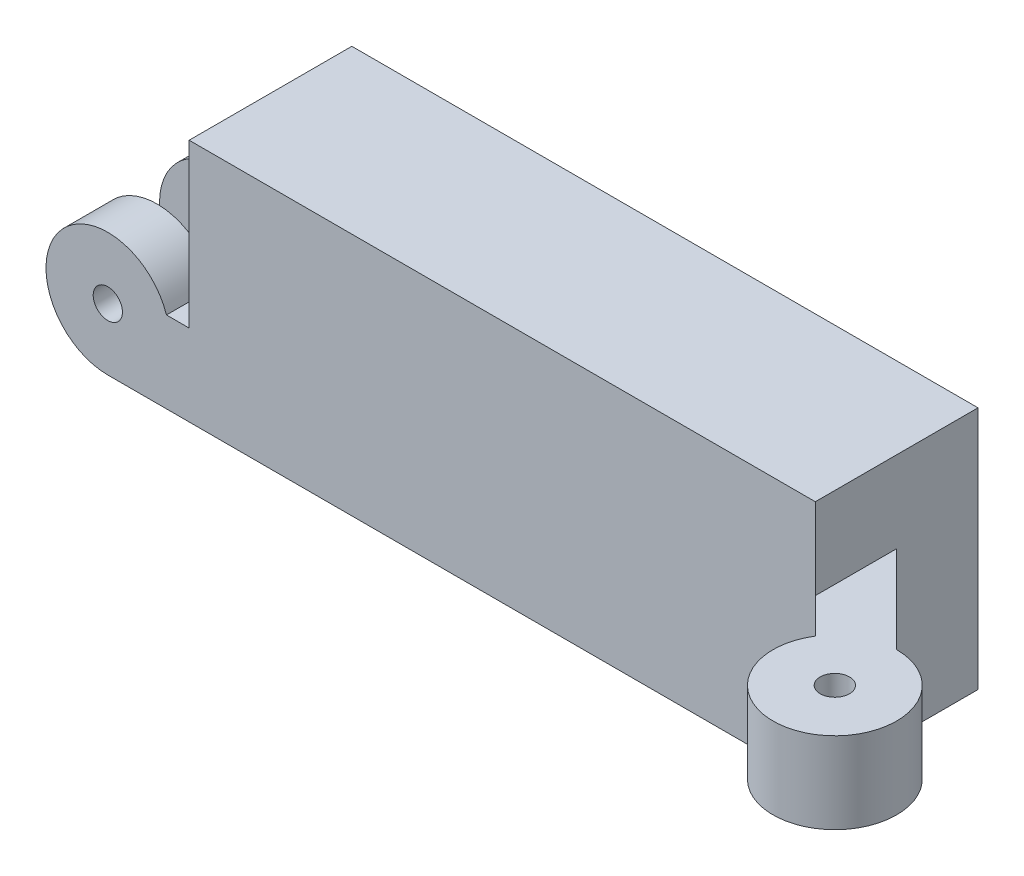
ISO-10303-21;
HEADER;
FILE_DESCRIPTION(('STEP AP214'),'2;1');
FILE_NAME('part.step','',(''),(''),'','','');
FILE_SCHEMA(('AUTOMOTIVE_DESIGN { 1 0 10303 214 1 1 1 1 }'));
ENDSEC;
DATA;
#1=APPLICATION_CONTEXT('core data for automotive mechanical design processes');
#2=APPLICATION_PROTOCOL_DEFINITION('international standard','automotive_design',2000,#1);
#3=PRODUCT_CONTEXT('',#1,'mechanical');
#4=PRODUCT('Part','Part','',(#3));
#5=PRODUCT_RELATED_PRODUCT_CATEGORY('part','',(#4));
#6=PRODUCT_DEFINITION_FORMATION('','',#4);
#7=PRODUCT_DEFINITION_CONTEXT('part definition',#1,'design');
#8=PRODUCT_DEFINITION('design','',#6,#7);
#9=PRODUCT_DEFINITION_SHAPE('','',#8);
#10=(LENGTH_UNIT() NAMED_UNIT(*) SI_UNIT(.MILLI.,.METRE.));
#11=(NAMED_UNIT(*) PLANE_ANGLE_UNIT() SI_UNIT($,.RADIAN.));
#12=(NAMED_UNIT(*) SI_UNIT($,.STERADIAN.) SOLID_ANGLE_UNIT());
#13=UNCERTAINTY_MEASURE_WITH_UNIT(LENGTH_MEASURE(1.E-05),#10,'distance_accuracy_value','');
#14=(GEOMETRIC_REPRESENTATION_CONTEXT(3) GLOBAL_UNCERTAINTY_ASSIGNED_CONTEXT((#13)) GLOBAL_UNIT_ASSIGNED_CONTEXT((#10,
#11,#12)) REPRESENTATION_CONTEXT('',''));
#15=CARTESIAN_POINT('',(0.,0.,0.));
#16=DIRECTION('',(0.,0.,1.));
#17=DIRECTION('',(1.,0.,0.));
#18=AXIS2_PLACEMENT_3D('',#15,#16,#17);
#19=CARTESIAN_POINT('',(48.881284,0.,12.7));
#20=DIRECTION('',(-1.,0.,0.));
#21=DIRECTION('',(0.,0.,1.));
#22=AXIS2_PLACEMENT_3D('',#19,#20,#21);
#23=PLANE('',#22);
#24=DIRECTION('',(0.,0.,1.));
#25=VECTOR('',#24,1.);
#26=CARTESIAN_POINT('',(48.8812840000037,12.7,291599.365));
#27=LINE('',#26,#25);
#28=CARTESIAN_POINT('',(48.8812840000037,12.7,6.34999999999764));
#29=VERTEX_POINT('',#28);
#30=CARTESIAN_POINT('',(48.8812840000037,12.7,12.6999999999953));
#31=VERTEX_POINT('',#30);
#32=EDGE_CURVE('E173',#29,#31,#27,.T.);
#33=ORIENTED_EDGE('',*,*,#32,.F.);
#34=DIRECTION('',(0.,1.,0.));
#35=VECTOR('',#34,1.);
#36=CARTESIAN_POINT('',(48.8812840000037,6.35,6.34999999999764));
#37=LINE('',#36,#35);
#38=CARTESIAN_POINT('',(48.8812840000037,6.35,6.34999999999764));
#39=VERTEX_POINT('',#38);
#40=EDGE_CURVE('E191',#39,#29,#37,.T.);
#41=ORIENTED_EDGE('',*,*,#40,.F.);
#42=DIRECTION('',(0.,0.,1.));
#43=VECTOR('',#42,1.);
#44=CARTESIAN_POINT('',(48.8812840000037,6.35,291599.365));
#45=LINE('',#44,#43);
#46=CARTESIAN_POINT('',(48.881284,6.35,12.7));
#47=VERTEX_POINT('',#46);
#48=EDGE_CURVE('E167',#39,#47,#45,.T.);
#49=ORIENTED_EDGE('',*,*,#48,.T.);
#50=DIRECTION('',(0.,1.,0.));
#51=VECTOR('',#50,1.);
#52=CARTESIAN_POINT('',(48.881284,0.,12.7));
#53=LINE('',#52,#51);
#54=CARTESIAN_POINT('',(48.881284,0.,12.7));
#55=VERTEX_POINT('',#54);
#56=EDGE_CURVE('E261',#55,#47,#53,.T.);
#57=ORIENTED_EDGE('',*,*,#56,.F.);
#58=DIRECTION('',(0.,0.,-1.));
#59=VECTOR('',#58,1.);
#60=CARTESIAN_POINT('',(48.881284,0.,12.7));
#61=LINE('',#60,#59);
#62=CARTESIAN_POINT('',(48.881284,0.,0.));
#63=VERTEX_POINT('',#62);
#64=EDGE_CURVE('E58',#55,#63,#61,.T.);
#65=ORIENTED_EDGE('',*,*,#64,.T.);
#66=DIRECTION('',(0.,1.,0.));
#67=VECTOR('',#66,1.);
#68=CARTESIAN_POINT('',(48.881284,0.,0.));
#69=LINE('',#68,#67);
#70=CARTESIAN_POINT('',(48.881284,19.05,0.));
#71=VERTEX_POINT('',#70);
#72=EDGE_CURVE('E270',#63,#71,#69,.T.);
#73=ORIENTED_EDGE('',*,*,#72,.T.);
#74=DIRECTION('',(0.,0.,-1.));
#75=VECTOR('',#74,1.);
#76=CARTESIAN_POINT('',(48.881284,19.05,12.7));
#77=LINE('',#76,#75);
#78=CARTESIAN_POINT('',(48.881284,19.05,12.7));
#79=VERTEX_POINT('',#78);
#80=EDGE_CURVE('E275',#79,#71,#77,.T.);
#81=ORIENTED_EDGE('',*,*,#80,.F.);
#82=EDGE_CURVE('E260',#31,#79,#53,.T.);
#83=ORIENTED_EDGE('',*,*,#82,.F.);
#84=EDGE_LOOP('',(#33,#41,#49,#57,#65,#73,#81,#83));
#85=FACE_BOUND('',#84,.T.);
#86=ADVANCED_FACE('F50',(#85),#23,.F.);
#87=CARTESIAN_POINT('',(0.,19.05,12.7));
#88=DIRECTION('',(1.,0.,0.));
#89=DIRECTION('',(0.,1.,0.));
#90=AXIS2_PLACEMENT_3D('',#87,#88,#89);
#91=PLANE('',#90);
#92=DIRECTION('',(0.,1.,0.));
#93=VECTOR('',#92,1.);
#94=CARTESIAN_POINT('',(0.,0.,8.86354166666666));
#95=LINE('',#94,#93);
#96=CARTESIAN_POINT('',(0.,0.,8.86354166666666));
#97=VERTEX_POINT('',#96);
#98=CARTESIAN_POINT('',(0.,6.35,8.86354166666666));
#99=VERTEX_POINT('',#98);
#100=EDGE_CURVE('E212',#97,#99,#95,.T.);
#101=ORIENTED_EDGE('',*,*,#100,.T.);
#102=DIRECTION('',(0.,0.,-1.));
#103=VECTOR('',#102,1.);
#104=CARTESIAN_POINT('',(0.,6.35,12.7));
#105=LINE('',#104,#103);
#106=CARTESIAN_POINT('',(0.,6.35,12.7));
#107=VERTEX_POINT('',#106);
#108=EDGE_CURVE('E220',#107,#99,#105,.T.);
#109=ORIENTED_EDGE('',*,*,#108,.F.);
#110=DIRECTION('',(0.,-1.,0.));
#111=VECTOR('',#110,1.);
#112=CARTESIAN_POINT('',(0.,19.05,12.7));
#113=LINE('',#112,#111);
#114=CARTESIAN_POINT('',(0.,19.05,12.7));
#115=VERTEX_POINT('',#114);
#116=EDGE_CURVE('E254',#115,#107,#113,.T.);
#117=ORIENTED_EDGE('',*,*,#116,.F.);
#118=DIRECTION('',(0.,0.,-1.));
#119=VECTOR('',#118,1.);
#120=CARTESIAN_POINT('',(0.,19.05,12.7));
#121=LINE('',#120,#119);
#122=CARTESIAN_POINT('',(0.,19.05,0.));
#123=VERTEX_POINT('',#122);
#124=EDGE_CURVE('E266',#115,#123,#121,.T.);
#125=ORIENTED_EDGE('',*,*,#124,.T.);
#126=DIRECTION('',(0.,-1.,0.));
#127=VECTOR('',#126,1.);
#128=CARTESIAN_POINT('',(0.,19.05,0.));
#129=LINE('',#128,#127);
#130=CARTESIAN_POINT('',(0.,6.35,0.));
#131=VERTEX_POINT('',#130);
#132=EDGE_CURVE('E249',#123,#131,#129,.T.);
#133=ORIENTED_EDGE('',*,*,#132,.T.);
#134=DIRECTION('',(0.,0.,-1.));
#135=VECTOR('',#134,1.);
#136=CARTESIAN_POINT('',(0.,6.35,3.83645833333333));
#137=LINE('',#136,#135);
#138=CARTESIAN_POINT('',(0.,6.35,3.83645833333333));
#139=VERTEX_POINT('',#138);
#140=EDGE_CURVE('E250',#139,#131,#137,.T.);
#141=ORIENTED_EDGE('',*,*,#140,.F.);
#142=DIRECTION('',(0.,1.,0.));
#143=VECTOR('',#142,1.);
#144=CARTESIAN_POINT('',(0.,0.,3.83645833333333));
#145=LINE('',#144,#143);
#146=CARTESIAN_POINT('',(0.,0.,3.83645833333333));
#147=VERTEX_POINT('',#146);
#148=EDGE_CURVE('E233',#147,#139,#145,.T.);
#149=ORIENTED_EDGE('',*,*,#148,.F.);
#150=DIRECTION('',(0.,0.,-1.));
#151=VECTOR('',#150,1.);
#152=CARTESIAN_POINT('',(0.,0.,12.7));
#153=LINE('',#152,#151);
#154=EDGE_CURVE('E12',#97,#147,#153,.T.);
#155=ORIENTED_EDGE('',*,*,#154,.F.);
#156=EDGE_LOOP('',(#101,#109,#117,#125,#133,#141,#149,#155));
#157=FACE_BOUND('',#156,.T.);
#158=ADVANCED_FACE('F52',(#157),#91,.F.);
#159=CARTESIAN_POINT('',(0.,0.,12.7));
#160=DIRECTION('',(0.,1.,0.));
#161=DIRECTION('',(0.,0.,1.));
#162=AXIS2_PLACEMENT_3D('',#159,#160,#161);
#163=PLANE('',#162);
#164=DIRECTION('',(1.,0.,0.));
#165=VECTOR('',#164,1.);
#166=CARTESIAN_POINT('',(0.,0.,0.));
#167=LINE('',#166,#165);
#168=CARTESIAN_POINT('',(-6.35,0.,0.));
#169=VERTEX_POINT('',#168);
#170=EDGE_CURVE('E268',#169,#63,#167,.T.);
#171=ORIENTED_EDGE('',*,*,#170,.T.);
#172=ORIENTED_EDGE('',*,*,#64,.F.);
#173=DIRECTION('',(1.,0.,0.));
#174=VECTOR('',#173,1.);
#175=CARTESIAN_POINT('',(0.,0.,12.7));
#176=LINE('',#175,#174);
#177=CARTESIAN_POINT('',(-6.35,0.,12.7));
#178=VERTEX_POINT('',#177);
#179=EDGE_CURVE('E257',#178,#55,#176,.T.);
#180=ORIENTED_EDGE('',*,*,#179,.F.);
#181=DIRECTION('',(0.,0.,-1.));
#182=VECTOR('',#181,1.);
#183=CARTESIAN_POINT('',(-6.35,0.,12.7));
#184=LINE('',#183,#182);
#185=CARTESIAN_POINT('',(-6.35,0.,8.86354166666666));
#186=VERTEX_POINT('',#185);
#187=EDGE_CURVE('E217',#178,#186,#184,.T.);
#188=ORIENTED_EDGE('',*,*,#187,.T.);
#189=DIRECTION('',(-1.,0.,0.));
#190=VECTOR('',#189,1.);
#191=CARTESIAN_POINT('',(0.,0.,8.86354166666666));
#192=LINE('',#191,#190);
#193=EDGE_CURVE('E198',#97,#186,#192,.T.);
#194=ORIENTED_EDGE('',*,*,#193,.F.);
#195=ORIENTED_EDGE('',*,*,#154,.T.);
#196=DIRECTION('',(-1.,0.,0.));
#197=VECTOR('',#196,1.);
#198=CARTESIAN_POINT('',(0.,0.,3.83645833333333));
#199=LINE('',#198,#197);
#200=CARTESIAN_POINT('',(-6.35,0.,3.83645833333333));
#201=VERTEX_POINT('',#200);
#202=EDGE_CURVE('E236',#147,#201,#199,.T.);
#203=ORIENTED_EDGE('',*,*,#202,.T.);
#204=DIRECTION('',(0.,0.,-1.));
#205=VECTOR('',#204,1.);
#206=CARTESIAN_POINT('',(-6.35,0.,3.83645833333333));
#207=LINE('',#206,#205);
#208=EDGE_CURVE('E246',#201,#169,#207,.T.);
#209=ORIENTED_EDGE('',*,*,#208,.T.);
#210=EDGE_LOOP('',(#171,#172,#180,#188,#194,#195,#203,#209));
#211=FACE_BOUND('',#210,.T.);
#212=ADVANCED_FACE('F310',(#211),#163,.F.);
#213=CARTESIAN_POINT('',(48.881284,19.05,12.7));
#214=DIRECTION('',(0.,-1.,0.));
#215=DIRECTION('',(1.,0.,0.));
#216=AXIS2_PLACEMENT_3D('',#213,#214,#215);
#217=PLANE('',#216);
#218=DIRECTION('',(-1.,0.,0.));
#219=VECTOR('',#218,1.);
#220=CARTESIAN_POINT('',(48.881284,19.05,0.));
#221=LINE('',#220,#219);
#222=EDGE_CURVE('E258',#71,#123,#221,.T.);
#223=ORIENTED_EDGE('',*,*,#222,.T.);
#224=ORIENTED_EDGE('',*,*,#124,.F.);
#225=DIRECTION('',(-1.,0.,0.));
#226=VECTOR('',#225,1.);
#227=CARTESIAN_POINT('',(48.881284,19.05,12.7));
#228=LINE('',#227,#226);
#229=EDGE_CURVE('E264',#79,#115,#228,.T.);
#230=ORIENTED_EDGE('',*,*,#229,.F.);
#231=ORIENTED_EDGE('',*,*,#80,.T.);
#232=EDGE_LOOP('',(#223,#224,#230,#231));
#233=FACE_BOUND('',#232,.T.);
#234=ADVANCED_FACE('F291',(#233),#217,.F.);
#235=CARTESIAN_POINT('',(0.,0.,12.7));
#236=DIRECTION('',(0.,0.,1.));
#237=DIRECTION('',(1.,0.,0.));
#238=AXIS2_PLACEMENT_3D('',#235,#236,#237);
#239=PLANE('',#238);
#240=ORIENTED_EDGE('',*,*,#116,.T.);
#241=DIRECTION('',(1.,0.,0.));
#242=VECTOR('',#241,1.);
#243=CARTESIAN_POINT('',(0.,6.35,12.7));
#244=LINE('',#243,#242);
#245=CARTESIAN_POINT('',(-1.77094988016074,6.35,12.7));
#246=VERTEX_POINT('',#245);
#247=EDGE_CURVE('E201',#246,#107,#244,.T.);
#248=ORIENTED_EDGE('',*,*,#247,.F.);
#249=CARTESIAN_POINT('',(-6.35,4.826,12.7));
#250=DIRECTION('',(0.,0.,-1.));
#251=DIRECTION('',(-1.,0.,0.));
#252=AXIS2_PLACEMENT_3D('',#249,#250,#251);
#253=CIRCLE('',#252,4.826);
#254=EDGE_CURVE('E197',#178,#246,#253,.T.);
#255=ORIENTED_EDGE('',*,*,#254,.F.);
#256=ORIENTED_EDGE('',*,*,#179,.T.);
#257=ORIENTED_EDGE('',*,*,#56,.T.);
#258=DIRECTION('',(0.,1.,0.));
#259=VECTOR('',#258,1.);
#260=CARTESIAN_POINT('',(48.8812840000037,6.35,12.6999999999953));
#261=LINE('',#260,#259);
#262=EDGE_CURVE('E171',#47,#31,#261,.T.);
#263=ORIENTED_EDGE('',*,*,#262,.T.);
#264=ORIENTED_EDGE('',*,*,#82,.T.);
#265=ORIENTED_EDGE('',*,*,#229,.T.);
#266=EDGE_LOOP('',(#240,#248,#255,#256,#257,#263,#264,#265));
#267=FACE_BOUND('',#266,.T.);
#268=CARTESIAN_POINT('',(-6.35,4.826,12.7));
#269=DIRECTION('',(0.,0.,-1.));
#270=DIRECTION('',(-1.,0.,0.));
#271=AXIS2_PLACEMENT_3D('',#268,#269,#270);
#272=CIRCLE('',#271,1.143);
#273=CARTESIAN_POINT('',(-7.493,4.826,12.7));
#274=VERTEX_POINT('',#273);
#275=EDGE_CURVE('E194',#274,#274,#272,.T.);
#276=ORIENTED_EDGE('',*,*,#275,.T.);
#277=EDGE_LOOP('',(#276));
#278=FACE_BOUND('',#277,.T.);
#279=ADVANCED_FACE('F298',(#267,#278),#239,.T.);
#280=CARTESIAN_POINT('',(0.,0.,0.));
#281=DIRECTION('',(0.,0.,1.));
#282=DIRECTION('',(1.,0.,0.));
#283=AXIS2_PLACEMENT_3D('',#280,#281,#282);
#284=PLANE('',#283);
#285=CARTESIAN_POINT('',(45.579284,9.525,0.));
#286=DIRECTION('',(0.,0.,-1.));
#287=DIRECTION('',(-1.,0.,0.));
#288=AXIS2_PLACEMENT_3D('',#285,#286,#287);
#289=CIRCLE('',#288,0.508000000000002);
#290=CARTESIAN_POINT('',(45.071284,9.525,0.));
#291=VERTEX_POINT('',#290);
#292=EDGE_CURVE('E547',#291,#291,#289,.T.);
#293=ORIENTED_EDGE('',*,*,#292,.F.);
#294=EDGE_LOOP('',(#293));
#295=FACE_BOUND('',#294,.T.);
#296=CARTESIAN_POINT('',(3.06730399999999,9.525,0.));
#297=DIRECTION('',(0.,0.,-1.));
#298=DIRECTION('',(-1.,0.,0.));
#299=AXIS2_PLACEMENT_3D('',#296,#297,#298);
#300=CIRCLE('',#299,0.508);
#301=CARTESIAN_POINT('',(2.55930399999999,9.525,0.));
#302=VERTEX_POINT('',#301);
#303=EDGE_CURVE('E556',#302,#302,#300,.T.);
#304=ORIENTED_EDGE('',*,*,#303,.F.);
#305=EDGE_LOOP('',(#304));
#306=FACE_BOUND('',#305,.T.);
#307=ORIENTED_EDGE('',*,*,#132,.F.);
#308=ORIENTED_EDGE('',*,*,#222,.F.);
#309=ORIENTED_EDGE('',*,*,#72,.F.);
#310=ORIENTED_EDGE('',*,*,#170,.F.);
#311=CARTESIAN_POINT('',(-6.35,4.826,0.));
#312=DIRECTION('',(0.,0.,-1.));
#313=DIRECTION('',(-1.,0.,0.));
#314=AXIS2_PLACEMENT_3D('',#311,#312,#313);
#315=CIRCLE('',#314,4.826);
#316=CARTESIAN_POINT('',(-1.77094988016074,6.35,0.));
#317=VERTEX_POINT('',#316);
#318=EDGE_CURVE('E241',#169,#317,#315,.T.);
#319=ORIENTED_EDGE('',*,*,#318,.T.);
#320=DIRECTION('',(1.,0.,0.));
#321=VECTOR('',#320,1.);
#322=CARTESIAN_POINT('',(0.,6.35,0.));
#323=LINE('',#322,#321);
#324=EDGE_CURVE('E227',#317,#131,#323,.T.);
#325=ORIENTED_EDGE('',*,*,#324,.T.);
#326=EDGE_LOOP('',(#307,#308,#309,#310,#319,#325));
#327=FACE_BOUND('',#326,.T.);
#328=CARTESIAN_POINT('',(-6.35,4.826,0.));
#329=DIRECTION('',(0.,0.,-1.));
#330=DIRECTION('',(-1.,0.,0.));
#331=AXIS2_PLACEMENT_3D('',#328,#329,#330);
#332=CIRCLE('',#331,1.143);
#333=CARTESIAN_POINT('',(-7.493,4.826,0.));
#334=VERTEX_POINT('',#333);
#335=EDGE_CURVE('E219',#334,#334,#332,.T.);
#336=ORIENTED_EDGE('',*,*,#335,.F.);
#337=EDGE_LOOP('',(#336));
#338=FACE_BOUND('',#337,.T.);
#339=ADVANCED_FACE('F287',(#295,#306,#327,#338),#284,.F.);
#340=CARTESIAN_POINT('',(-6.35,4.826,3.83645833333333));
#341=DIRECTION('',(0.,0.,-1.));
#342=DIRECTION('',(-1.,0.,0.));
#343=AXIS2_PLACEMENT_3D('',#340,#341,#342);
#344=CYLINDRICAL_SURFACE('',#343,4.826);
#345=ORIENTED_EDGE('',*,*,#318,.F.);
#346=ORIENTED_EDGE('',*,*,#208,.F.);
#347=CARTESIAN_POINT('',(-6.35,4.826,3.83645833333333));
#348=DIRECTION('',(0.,0.,-1.));
#349=DIRECTION('',(-1.,0.,0.));
#350=AXIS2_PLACEMENT_3D('',#347,#348,#349);
#351=CIRCLE('',#350,4.826);
#352=CARTESIAN_POINT('',(-1.77094988016074,6.35,3.83645833333333));
#353=VERTEX_POINT('',#352);
#354=EDGE_CURVE('E226',#201,#353,#351,.T.);
#355=ORIENTED_EDGE('',*,*,#354,.T.);
#356=DIRECTION('',(0.,0.,-1.));
#357=VECTOR('',#356,1.);
#358=CARTESIAN_POINT('',(-1.77094988016074,6.35,3.83645833333333));
#359=LINE('',#358,#357);
#360=EDGE_CURVE('E238',#353,#317,#359,.T.);
#361=ORIENTED_EDGE('',*,*,#360,.T.);
#362=EDGE_LOOP('',(#345,#346,#355,#361));
#363=FACE_BOUND('',#362,.T.);
#364=ADVANCED_FACE('F324',(#363),#344,.T.);
#365=CARTESIAN_POINT('',(-6.35,4.826,3.83645833333333));
#366=DIRECTION('',(0.,0.,-1.));
#367=DIRECTION('',(-1.,0.,0.));
#368=AXIS2_PLACEMENT_3D('',#365,#366,#367);
#369=CYLINDRICAL_SURFACE('',#368,1.143);
#370=CARTESIAN_POINT('',(-6.35,4.826,3.83645833333333));
#371=DIRECTION('',(0.,0.,-1.));
#372=DIRECTION('',(-1.,0.,0.));
#373=AXIS2_PLACEMENT_3D('',#370,#371,#372);
#374=CIRCLE('',#373,1.143);
#375=CARTESIAN_POINT('',(-7.493,4.826,3.83645833333333));
#376=VERTEX_POINT('',#375);
#377=EDGE_CURVE('E223',#376,#376,#374,.T.);
#378=ORIENTED_EDGE('',*,*,#377,.F.);
#379=EDGE_LOOP('',(#378));
#380=FACE_BOUND('',#379,.T.);
#381=ORIENTED_EDGE('',*,*,#335,.T.);
#382=EDGE_LOOP('',(#381));
#383=FACE_BOUND('',#382,.T.);
#384=ADVANCED_FACE('F329',(#380,#383),#369,.F.);
#385=CARTESIAN_POINT('',(0.,6.35,3.83645833333333));
#386=DIRECTION('',(0.,1.,0.));
#387=DIRECTION('',(-1.,0.,0.));
#388=AXIS2_PLACEMENT_3D('',#385,#386,#387);
#389=PLANE('',#388);
#390=ORIENTED_EDGE('',*,*,#324,.F.);
#391=ORIENTED_EDGE('',*,*,#360,.F.);
#392=DIRECTION('',(1.,0.,0.));
#393=VECTOR('',#392,1.);
#394=CARTESIAN_POINT('',(0.,6.35,3.83645833333333));
#395=LINE('',#394,#393);
#396=EDGE_CURVE('E230',#353,#139,#395,.T.);
#397=ORIENTED_EDGE('',*,*,#396,.T.);
#398=ORIENTED_EDGE('',*,*,#140,.T.);
#399=EDGE_LOOP('',(#390,#391,#397,#398));
#400=FACE_BOUND('',#399,.T.);
#401=ADVANCED_FACE('F327',(#400),#389,.T.);
#402=CARTESIAN_POINT('',(0.,0.,3.83645833333333));
#403=DIRECTION('',(0.,0.,-1.));
#404=DIRECTION('',(-1.,0.,0.));
#405=AXIS2_PLACEMENT_3D('',#402,#403,#404);
#406=PLANE('',#405);
#407=ORIENTED_EDGE('',*,*,#377,.T.);
#408=EDGE_LOOP('',(#407));
#409=FACE_BOUND('',#408,.T.);
#410=ORIENTED_EDGE('',*,*,#354,.F.);
#411=ORIENTED_EDGE('',*,*,#202,.F.);
#412=ORIENTED_EDGE('',*,*,#148,.T.);
#413=ORIENTED_EDGE('',*,*,#396,.F.);
#414=EDGE_LOOP('',(#410,#411,#412,#413));
#415=FACE_BOUND('',#414,.T.);
#416=ADVANCED_FACE('F321',(#409,#415),#406,.F.);
#417=CARTESIAN_POINT('',(-6.35,4.826,12.7));
#418=DIRECTION('',(0.,0.,-1.));
#419=DIRECTION('',(-1.,0.,0.));
#420=AXIS2_PLACEMENT_3D('',#417,#418,#419);
#421=CYLINDRICAL_SURFACE('',#420,4.826);
#422=CARTESIAN_POINT('',(-6.35,4.826,8.86354166666666));
#423=DIRECTION('',(0.,0.,-1.));
#424=DIRECTION('',(-1.,0.,0.));
#425=AXIS2_PLACEMENT_3D('',#422,#423,#424);
#426=CIRCLE('',#425,4.826);
#427=CARTESIAN_POINT('',(-1.77094988016074,6.35,8.86354166666666));
#428=VERTEX_POINT('',#427);
#429=EDGE_CURVE('E206',#186,#428,#426,.T.);
#430=ORIENTED_EDGE('',*,*,#429,.F.);
#431=ORIENTED_EDGE('',*,*,#187,.F.);
#432=ORIENTED_EDGE('',*,*,#254,.T.);
#433=DIRECTION('',(0.,0.,-1.));
#434=VECTOR('',#433,1.);
#435=CARTESIAN_POINT('',(-1.77094988016074,6.35,12.7));
#436=LINE('',#435,#434);
#437=EDGE_CURVE('E203',#246,#428,#436,.T.);
#438=ORIENTED_EDGE('',*,*,#437,.T.);
#439=EDGE_LOOP('',(#430,#431,#432,#438));
#440=FACE_BOUND('',#439,.T.);
#441=ADVANCED_FACE('F313',(#440),#421,.T.);
#442=CARTESIAN_POINT('',(-6.35,4.826,12.7));
#443=DIRECTION('',(0.,0.,-1.));
#444=DIRECTION('',(-1.,0.,0.));
#445=AXIS2_PLACEMENT_3D('',#442,#443,#444);
#446=CYLINDRICAL_SURFACE('',#445,1.143);
#447=ORIENTED_EDGE('',*,*,#275,.F.);
#448=EDGE_LOOP('',(#447));
#449=FACE_BOUND('',#448,.T.);
#450=CARTESIAN_POINT('',(-6.35,4.826,8.86354166666666));
#451=DIRECTION('',(0.,0.,-1.));
#452=DIRECTION('',(-1.,0.,0.));
#453=AXIS2_PLACEMENT_3D('',#450,#451,#452);
#454=CIRCLE('',#453,1.143);
#455=CARTESIAN_POINT('',(-7.493,4.826,8.86354166666666));
#456=VERTEX_POINT('',#455);
#457=EDGE_CURVE('E190',#456,#456,#454,.T.);
#458=ORIENTED_EDGE('',*,*,#457,.T.);
#459=EDGE_LOOP('',(#458));
#460=FACE_BOUND('',#459,.T.);
#461=ADVANCED_FACE('F402',(#449,#460),#446,.F.);
#462=CARTESIAN_POINT('',(0.,6.35,12.7));
#463=DIRECTION('',(0.,1.,0.));
#464=DIRECTION('',(-1.,0.,0.));
#465=AXIS2_PLACEMENT_3D('',#462,#463,#464);
#466=PLANE('',#465);
#467=DIRECTION('',(1.,0.,0.));
#468=VECTOR('',#467,1.);
#469=CARTESIAN_POINT('',(0.,6.35,8.86354166666666));
#470=LINE('',#469,#468);
#471=EDGE_CURVE('E209',#428,#99,#470,.T.);
#472=ORIENTED_EDGE('',*,*,#471,.F.);
#473=ORIENTED_EDGE('',*,*,#437,.F.);
#474=ORIENTED_EDGE('',*,*,#247,.T.);
#475=ORIENTED_EDGE('',*,*,#108,.T.);
#476=EDGE_LOOP('',(#472,#473,#474,#475));
#477=FACE_BOUND('',#476,.T.);
#478=ADVANCED_FACE('F412',(#477),#466,.T.);
#479=CARTESIAN_POINT('',(0.,0.,8.86354166666666));
#480=DIRECTION('',(0.,0.,-1.));
#481=DIRECTION('',(-1.,0.,0.));
#482=AXIS2_PLACEMENT_3D('',#479,#480,#481);
#483=PLANE('',#482);
#484=ORIENTED_EDGE('',*,*,#457,.F.);
#485=EDGE_LOOP('',(#484));
#486=FACE_BOUND('',#485,.T.);
#487=ORIENTED_EDGE('',*,*,#429,.T.);
#488=ORIENTED_EDGE('',*,*,#471,.T.);
#489=ORIENTED_EDGE('',*,*,#100,.F.);
#490=ORIENTED_EDGE('',*,*,#193,.T.);
#491=EDGE_LOOP('',(#487,#488,#489,#490));
#492=FACE_BOUND('',#491,.T.);
#493=ADVANCED_FACE('F316',(#486,#492),#483,.T.);
#494=CARTESIAN_POINT('',(55.7062786520125,6.35,18.0009946520126));
#495=DIRECTION('',(0.,-1.,0.));
#496=DIRECTION('',(0.,0.,-1.));
#497=AXIS2_PLACEMENT_3D('',#494,#495,#496);
#498=PLANE('',#497);
#499=DIRECTION('',(0.707106781186543,0.,0.707106781186552));
#500=VECTOR('',#499,1.);
#501=CARTESIAN_POINT('',(345829.238456176,6.35,345793.05717218));
#502=LINE('',#501,#500);
#503=CARTESIAN_POINT('',(51.6179452351449,6.35,15.4366612352114));
#504=VERTEX_POINT('',#503);
#505=EDGE_CURVE('E65',#47,#504,#502,.T.);
#506=ORIENTED_EDGE('',*,*,#505,.F.);
#507=ORIENTED_EDGE('',*,*,#48,.F.);
#508=DIRECTION('',(0.707106781186544,0.,0.707106781186551));
#509=VECTOR('',#508,1.);
#510=CARTESIAN_POINT('',(345832.413456176,6.35,345789.88217218));
#511=LINE('',#510,#509);
#512=CARTESIAN_POINT('',(55.7062786519964,6.35,13.1749946520472));
#513=VERTEX_POINT('',#512);
#514=EDGE_CURVE('E154',#39,#513,#511,.T.);
#515=ORIENTED_EDGE('',*,*,#514,.T.);
#516=CARTESIAN_POINT('',(55.7062786520125,6.35,18.0009946520126));
#517=DIRECTION('',(0.,-1.,0.));
#518=DIRECTION('',(0.,0.,-1.));
#519=AXIS2_PLACEMENT_3D('',#516,#517,#518);
#520=CIRCLE('',#519,4.82599999999999);
#521=EDGE_CURVE('E150',#513,#504,#520,.T.);
#522=ORIENTED_EDGE('',*,*,#521,.T.);
#523=EDGE_LOOP('',(#506,#507,#515,#522));
#524=FACE_BOUND('',#523,.T.);
#525=CARTESIAN_POINT('',(55.7062786520125,6.35,18.0009946520126));
#526=DIRECTION('',(0.,-1.,0.));
#527=DIRECTION('',(0.,0.,-1.));
#528=AXIS2_PLACEMENT_3D('',#525,#526,#527);
#529=CIRCLE('',#528,1.143);
#530=CARTESIAN_POINT('',(55.7062786520125,6.35,16.8579946520126));
#531=VERTEX_POINT('',#530);
#532=EDGE_CURVE('E186',#531,#531,#529,.T.);
#533=ORIENTED_EDGE('',*,*,#532,.F.);
#534=EDGE_LOOP('',(#533));
#535=FACE_BOUND('',#534,.T.);
#536=ADVANCED_FACE('F152',(#524,#535),#498,.T.);
#537=CARTESIAN_POINT('',(55.7062786520125,12.7,18.0009946520126));
#538=DIRECTION('',(0.,-1.,0.));
#539=DIRECTION('',(0.,0.,-1.));
#540=AXIS2_PLACEMENT_3D('',#537,#538,#539);
#541=PLANE('',#540);
#542=DIRECTION('',(0.707106781186543,0.,0.707106781186552));
#543=VECTOR('',#542,1.);
#544=CARTESIAN_POINT('',(345829.238456176,12.7,345793.05717218));
#545=LINE('',#544,#543);
#546=CARTESIAN_POINT('',(51.6179452351449,12.7,15.4366612352114));
#547=VERTEX_POINT('',#546);
#548=EDGE_CURVE('E184',#31,#547,#545,.T.);
#549=ORIENTED_EDGE('',*,*,#548,.T.);
#550=CARTESIAN_POINT('',(55.7062786520125,12.7,18.0009946520126));
#551=DIRECTION('',(0.,-1.,0.));
#552=DIRECTION('',(0.,0.,-1.));
#553=AXIS2_PLACEMENT_3D('',#550,#551,#552);
#554=CIRCLE('',#553,4.82599999999999);
#555=CARTESIAN_POINT('',(55.7062786519964,12.7,13.1749946520472));
#556=VERTEX_POINT('',#555);
#557=EDGE_CURVE('E163',#556,#547,#554,.T.);
#558=ORIENTED_EDGE('',*,*,#557,.F.);
#559=DIRECTION('',(0.707106781186544,0.,0.707106781186551));
#560=VECTOR('',#559,1.);
#561=CARTESIAN_POINT('',(345832.413456176,12.7,345789.88217218));
#562=LINE('',#561,#560);
#563=EDGE_CURVE('E176',#29,#556,#562,.T.);
#564=ORIENTED_EDGE('',*,*,#563,.F.);
#565=ORIENTED_EDGE('',*,*,#32,.T.);
#566=EDGE_LOOP('',(#549,#558,#564,#565));
#567=FACE_BOUND('',#566,.T.);
#568=CARTESIAN_POINT('',(55.7062786520125,12.7,18.0009946520126));
#569=DIRECTION('',(0.,-1.,0.));
#570=DIRECTION('',(0.,0.,-1.));
#571=AXIS2_PLACEMENT_3D('',#568,#569,#570);
#572=CIRCLE('',#571,1.143);
#573=CARTESIAN_POINT('',(55.7062786520125,12.7,16.8579946520126));
#574=VERTEX_POINT('',#573);
#575=EDGE_CURVE('E179',#574,#574,#572,.T.);
#576=ORIENTED_EDGE('',*,*,#575,.T.);
#577=EDGE_LOOP('',(#576));
#578=FACE_BOUND('',#577,.T.);
#579=ADVANCED_FACE('F305',(#567,#578),#541,.F.);
#580=CARTESIAN_POINT('',(345829.238456176,6.35,345793.05717218));
#581=DIRECTION('',(-0.707106781186552,0.,0.707106781186543));
#582=DIRECTION('',(0.707106781186543,0.,0.707106781186552));
#583=AXIS2_PLACEMENT_3D('',#580,#581,#582);
#584=PLANE('',#583);
#585=ORIENTED_EDGE('',*,*,#548,.F.);
#586=ORIENTED_EDGE('',*,*,#262,.F.);
#587=ORIENTED_EDGE('',*,*,#505,.T.);
#588=DIRECTION('',(0.,1.,0.));
#589=VECTOR('',#588,1.);
#590=CARTESIAN_POINT('',(51.6179452351449,6.35,15.4366612352114));
#591=LINE('',#590,#589);
#592=EDGE_CURVE('E160',#504,#547,#591,.T.);
#593=ORIENTED_EDGE('',*,*,#592,.T.);
#594=EDGE_LOOP('',(#585,#586,#587,#593));
#595=FACE_BOUND('',#594,.T.);
#596=ADVANCED_FACE('F169',(#595),#584,.T.);
#597=CARTESIAN_POINT('',(345832.413456176,6.35,345789.88217218));
#598=DIRECTION('',(-0.707106781186551,0.,0.707106781186544));
#599=DIRECTION('',(0.707106781186544,0.,0.707106781186551));
#600=AXIS2_PLACEMENT_3D('',#597,#598,#599);
#601=PLANE('',#600);
#602=ORIENTED_EDGE('',*,*,#563,.T.);
#603=DIRECTION('',(0.,1.,0.));
#604=VECTOR('',#603,1.);
#605=CARTESIAN_POINT('',(55.7062786519964,6.35,13.1749946520472));
#606=LINE('',#605,#604);
#607=EDGE_CURVE('E166',#513,#556,#606,.T.);
#608=ORIENTED_EDGE('',*,*,#607,.F.);
#609=ORIENTED_EDGE('',*,*,#514,.F.);
#610=ORIENTED_EDGE('',*,*,#40,.T.);
#611=EDGE_LOOP('',(#602,#608,#609,#610));
#612=FACE_BOUND('',#611,.T.);
#613=ADVANCED_FACE('F308',(#612),#601,.F.);
#614=CARTESIAN_POINT('',(55.7062786520125,6.35,18.0009946520126));
#615=DIRECTION('',(0.,1.,0.));
#616=DIRECTION('',(0.,0.,1.));
#617=AXIS2_PLACEMENT_3D('',#614,#615,#616);
#618=CYLINDRICAL_SURFACE('',#617,4.82599999999999);
#619=ORIENTED_EDGE('',*,*,#557,.T.);
#620=ORIENTED_EDGE('',*,*,#592,.F.);
#621=ORIENTED_EDGE('',*,*,#521,.F.);
#622=ORIENTED_EDGE('',*,*,#607,.T.);
#623=EDGE_LOOP('',(#619,#620,#621,#622));
#624=FACE_BOUND('',#623,.T.);
#625=ADVANCED_FACE('F161',(#624),#618,.T.);
#626=CARTESIAN_POINT('',(55.7062786520125,6.35,18.0009946520126));
#627=DIRECTION('',(0.,1.,0.));
#628=DIRECTION('',(0.,0.,1.));
#629=AXIS2_PLACEMENT_3D('',#626,#627,#628);
#630=CYLINDRICAL_SURFACE('',#629,1.143);
#631=ORIENTED_EDGE('',*,*,#532,.T.);
#632=EDGE_LOOP('',(#631));
#633=FACE_BOUND('',#632,.T.);
#634=ORIENTED_EDGE('',*,*,#575,.F.);
#635=EDGE_LOOP('',(#634));
#636=FACE_BOUND('',#635,.T.);
#637=ADVANCED_FACE('F486',(#633,#636),#630,.F.);
#638=CARTESIAN_POINT('',(3.06730399999999,9.525,7.62));
#639=DIRECTION('',(0.,0.,-1.));
#640=DIRECTION('',(-1.,0.,0.));
#641=AXIS2_PLACEMENT_3D('',#638,#639,#640);
#642=CYLINDRICAL_SURFACE('',#641,0.508);
#643=CARTESIAN_POINT('',(3.06730399999999,9.525,7.62));
#644=DIRECTION('',(0.,0.,-1.));
#645=DIRECTION('',(-1.,0.,0.));
#646=AXIS2_PLACEMENT_3D('',#643,#644,#645);
#647=CIRCLE('',#646,0.508);
#648=CARTESIAN_POINT('',(2.55930399999999,9.525,7.62));
#649=VERTEX_POINT('',#648);
#650=EDGE_CURVE('E551',#649,#649,#647,.T.);
#651=ORIENTED_EDGE('',*,*,#650,.F.);
#652=EDGE_LOOP('',(#651));
#653=FACE_BOUND('',#652,.T.);
#654=ORIENTED_EDGE('',*,*,#303,.T.);
#655=EDGE_LOOP('',(#654));
#656=FACE_BOUND('',#655,.T.);
#657=ADVANCED_FACE('F494',(#653,#656),#642,.F.);
#658=CARTESIAN_POINT('',(3.06730399999999,9.525,7.62));
#659=DIRECTION('',(0.,0.,-1.));
#660=DIRECTION('',(-1.,0.,0.));
#661=AXIS2_PLACEMENT_3D('',#658,#659,#660);
#662=PLANE('',#661);
#663=ORIENTED_EDGE('',*,*,#650,.T.);
#664=EDGE_LOOP('',(#663));
#665=FACE_BOUND('',#664,.T.);
#666=ADVANCED_FACE('F510',(#665),#662,.T.);
#667=CARTESIAN_POINT('',(45.579284,9.525,7.62));
#668=DIRECTION('',(0.,0.,-1.));
#669=DIRECTION('',(-1.,0.,0.));
#670=AXIS2_PLACEMENT_3D('',#667,#668,#669);
#671=CYLINDRICAL_SURFACE('',#670,0.508000000000002);
#672=CARTESIAN_POINT('',(45.579284,9.525,7.62));
#673=DIRECTION('',(0.,0.,-1.));
#674=DIRECTION('',(-1.,0.,0.));
#675=AXIS2_PLACEMENT_3D('',#672,#673,#674);
#676=CIRCLE('',#675,0.508000000000002);
#677=CARTESIAN_POINT('',(45.071284,9.525,7.62));
#678=VERTEX_POINT('',#677);
#679=EDGE_CURVE('E546',#678,#678,#676,.T.);
#680=ORIENTED_EDGE('',*,*,#679,.F.);
#681=EDGE_LOOP('',(#680));
#682=FACE_BOUND('',#681,.T.);
#683=ORIENTED_EDGE('',*,*,#292,.T.);
#684=EDGE_LOOP('',(#683));
#685=FACE_BOUND('',#684,.T.);
#686=ADVANCED_FACE('F520',(#682,#685),#671,.F.);
#687=CARTESIAN_POINT('',(45.579284,9.525,7.62));
#688=DIRECTION('',(0.,0.,-1.));
#689=DIRECTION('',(-1.,0.,0.));
#690=AXIS2_PLACEMENT_3D('',#687,#688,#689);
#691=PLANE('',#690);
#692=ORIENTED_EDGE('',*,*,#679,.T.);
#693=EDGE_LOOP('',(#692));
#694=FACE_BOUND('',#693,.T.);
#695=ADVANCED_FACE('F530',(#694),#691,.T.);
#696=CLOSED_SHELL('',(#86,#158,#212,#234,#279,#339,#364,#384,#401,#416,#441,#461,#478,#493,#536,
#579,#596,#613,#625,#637,#657,#666,#686,#695));
#697=MANIFOLD_SOLID_BREP('B2',#696);
#698=ADVANCED_BREP_SHAPE_REPRESENTATION('',(#18,#697),#14);
#699=SHAPE_DEFINITION_REPRESENTATION(#9,#698);
ENDSEC;
END-ISO-10303-21;
